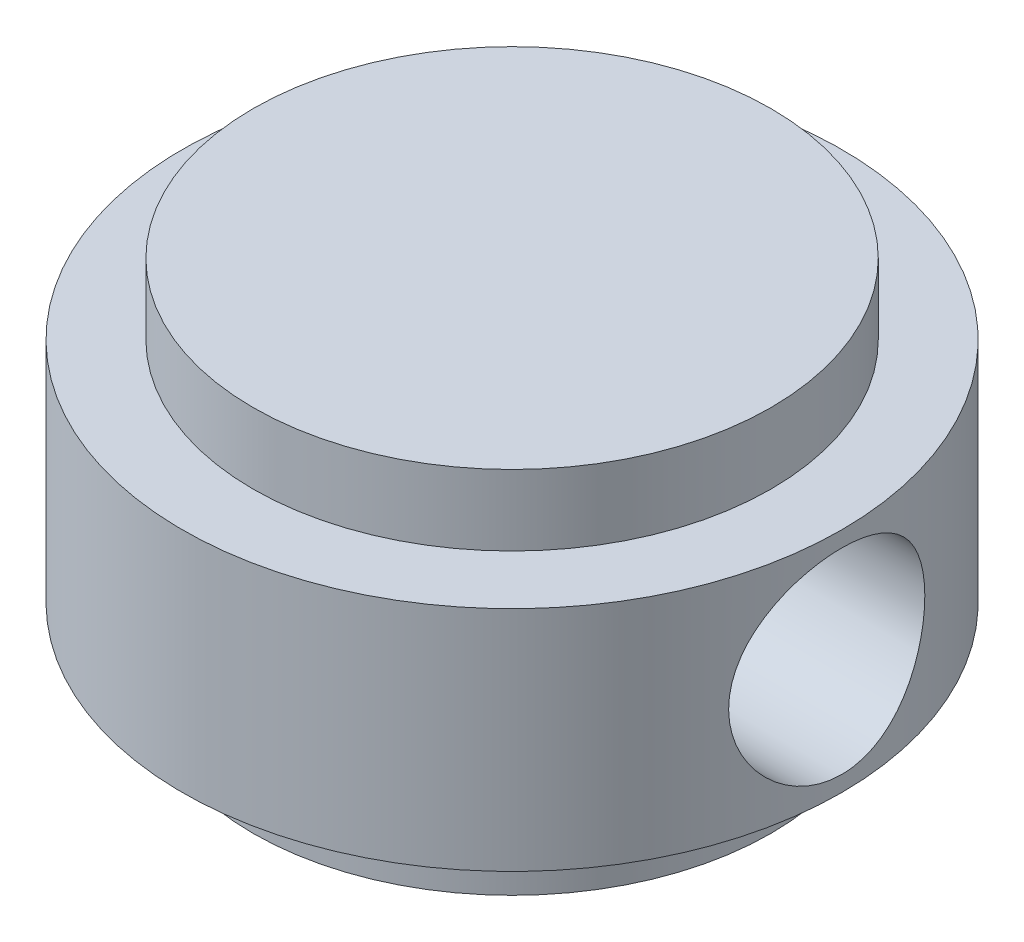
ISO-10303-21;
HEADER;
FILE_DESCRIPTION(('STEP AP214'),'2;1');
FILE_NAME('part.step','',(''),(''),'','','');
FILE_SCHEMA(('AUTOMOTIVE_DESIGN { 1 0 10303 214 1 1 1 1 }'));
ENDSEC;
DATA;
#1=APPLICATION_CONTEXT('core data for automotive mechanical design processes');
#2=APPLICATION_PROTOCOL_DEFINITION('international standard','automotive_design',2000,#1);
#3=PRODUCT_CONTEXT('',#1,'mechanical');
#4=PRODUCT('Part','Part','',(#3));
#5=PRODUCT_RELATED_PRODUCT_CATEGORY('part','',(#4));
#6=PRODUCT_DEFINITION_FORMATION('','',#4);
#7=PRODUCT_DEFINITION_CONTEXT('part definition',#1,'design');
#8=PRODUCT_DEFINITION('design','',#6,#7);
#9=PRODUCT_DEFINITION_SHAPE('','',#8);
#10=(LENGTH_UNIT() NAMED_UNIT(*) SI_UNIT(.MILLI.,.METRE.));
#11=(NAMED_UNIT(*) PLANE_ANGLE_UNIT() SI_UNIT($,.RADIAN.));
#12=(NAMED_UNIT(*) SI_UNIT($,.STERADIAN.) SOLID_ANGLE_UNIT());
#13=UNCERTAINTY_MEASURE_WITH_UNIT(LENGTH_MEASURE(1.E-05),#10,'distance_accuracy_value','');
#14=(GEOMETRIC_REPRESENTATION_CONTEXT(3) GLOBAL_UNCERTAINTY_ASSIGNED_CONTEXT((#13)) GLOBAL_UNIT_ASSIGNED_CONTEXT((#10,
#11,#12)) REPRESENTATION_CONTEXT('',''));
#15=CARTESIAN_POINT('',(0.,0.,0.));
#16=DIRECTION('',(0.,0.,1.));
#17=DIRECTION('',(1.,0.,0.));
#18=AXIS2_PLACEMENT_3D('',#15,#16,#17);
#19=CARTESIAN_POINT('',(750.,-23.4980000000005,1186.5));
#20=DIRECTION('',(0.,-1.,0.));
#21=DIRECTION('',(0.,0.,-1.));
#22=AXIS2_PLACEMENT_3D('',#19,#20,#21);
#23=PLANE('',#22);
#24=CARTESIAN_POINT('',(750.,-23.4980000000005,1186.5));
#25=DIRECTION('',(0.,-1.,0.));
#26=DIRECTION('',(1.,0.,0.));
#27=AXIS2_PLACEMENT_3D('',#24,#25,#26);
#28=CIRCLE('',#27,33.);
#29=CARTESIAN_POINT('',(783.,-23.4980000000005,1186.5));
#30=VERTEX_POINT('',#29);
#31=EDGE_CURVE('E19',#30,#30,#28,.F.);
#32=ORIENTED_EDGE('',*,*,#31,.F.);
#33=EDGE_LOOP('',(#32));
#34=FACE_BOUND('',#33,.T.);
#35=ADVANCED_FACE('F15',(#34),#23,.T.);
#36=CARTESIAN_POINT('',(750.,0.00199999999954403,1186.5));
#37=DIRECTION('',(0.,-1.,0.));
#38=DIRECTION('',(1.,0.,0.));
#39=AXIS2_PLACEMENT_3D('',#36,#37,#38);
#40=CYLINDRICAL_SURFACE('',#39,33.);
#41=CARTESIAN_POINT('',(750.,-14.4980000000005,1186.5));
#42=DIRECTION('',(0.,-1.,0.));
#43=DIRECTION('',(1.,0.,0.));
#44=AXIS2_PLACEMENT_3D('',#41,#42,#43);
#45=CIRCLE('',#44,33.);
#46=CARTESIAN_POINT('',(783.,-14.4980000000005,1186.5));
#47=VERTEX_POINT('',#46);
#48=EDGE_CURVE('E58',#47,#47,#45,.F.);
#49=ORIENTED_EDGE('',*,*,#48,.F.);
#50=EDGE_LOOP('',(#49));
#51=FACE_BOUND('',#50,.T.);
#52=ORIENTED_EDGE('',*,*,#31,.T.);
#53=EDGE_LOOP('',(#52));
#54=FACE_BOUND('',#53,.T.);
#55=ADVANCED_FACE('F65',(#51,#54),#40,.T.);
#56=CARTESIAN_POINT('',(783.,-14.4980000000005,1186.5));
#57=DIRECTION('',(0.,-1.,0.));
#58=DIRECTION('',(0.,0.,-1.));
#59=AXIS2_PLACEMENT_3D('',#56,#57,#58);
#60=PLANE('',#59);
#61=CARTESIAN_POINT('',(750.,-14.4980000000005,1186.5));
#62=DIRECTION('',(0.,-1.,0.));
#63=DIRECTION('',(1.,0.,0.));
#64=AXIS2_PLACEMENT_3D('',#61,#62,#63);
#65=CIRCLE('',#64,42.);
#66=CARTESIAN_POINT('',(792.,-14.4980000000005,1186.5));
#67=VERTEX_POINT('',#66);
#68=EDGE_CURVE('E41',#67,#67,#65,.F.);
#69=ORIENTED_EDGE('',*,*,#68,.F.);
#70=EDGE_LOOP('',(#69));
#71=FACE_BOUND('',#70,.T.);
#72=ORIENTED_EDGE('',*,*,#48,.T.);
#73=EDGE_LOOP('',(#72));
#74=FACE_BOUND('',#73,.T.);
#75=ADVANCED_FACE('F73',(#71,#74),#60,.T.);
#76=CARTESIAN_POINT('',(707.496,0.00199999999954403,1186.5));
#77=DIRECTION('',(1.,0.,0.));
#78=DIRECTION('',(0.,0.,-1.));
#79=AXIS2_PLACEMENT_3D('',#76,#77,#78);
#80=CYLINDRICAL_SURFACE('',#79,12.5);
#81=CARTESIAN_POINT('',(790.096757973682,0.00199999999954342,1174.));
#82=CARTESIAN_POINT('',(790.096752931004,-0.340553838329385,1173.99999355877));
#83=CARTESIAN_POINT('',(790.101156828677,-0.683030388726511,1174.01408685371));
#84=CARTESIAN_POINT('',(790.118623226506,-1.36555628130546,1174.07031787062));
#85=CARTESIAN_POINT('',(790.131687416486,-1.70560513669629,1174.11246106577));
#86=CARTESIAN_POINT('',(790.166087292935,-2.38094781440111,1174.22446174029));
#87=CARTESIAN_POINT('',(790.187429617309,-2.71623759638292,1174.29434146152));
#88=CARTESIAN_POINT('',(790.237727842652,-3.37943062586481,1174.4611942718));
#89=CARTESIAN_POINT('',(790.266684018744,-3.70733360598116,1174.5581683399));
#90=CARTESIAN_POINT('',(790.331277901422,-4.3528753433977,1174.77817736865));
#91=CARTESIAN_POINT('',(790.366902597465,-4.67053269895182,1174.90116164203));
#92=CARTESIAN_POINT('',(790.443834826176,-5.29418251164651,1175.17233149255));
#93=CARTESIAN_POINT('',(790.485142413306,-5.60017485695893,1175.3205173112));
#94=CARTESIAN_POINT('',(790.572266595086,-6.19851784976922,1175.64096084919));
#95=CARTESIAN_POINT('',(790.618082211461,-6.49087143676218,1175.81321334928));
#96=CARTESIAN_POINT('',(790.7129938626,-7.06034657637527,1176.18069075845));
#97=CARTESIAN_POINT('',(790.762091077532,-7.33746258305856,1176.37592395154));
#98=CARTESIAN_POINT('',(790.863636385959,-7.8821847585074,1176.79377978293));
#99=CARTESIAN_POINT('',(790.916139685551,-8.14931254921327,1177.01701285641));
#100=CARTESIAN_POINT('',(791.021792187301,-8.66407962754804,1177.48500562122));
#101=CARTESIAN_POINT('',(791.074941673949,-8.91170994401154,1177.72977511345));
#102=CARTESIAN_POINT('',(791.180437236192,-9.38585719266153,1178.23929301676));
#103=CARTESIAN_POINT('',(791.232783040611,-9.61236712377995,1178.50404800046));
#104=CARTESIAN_POINT('',(791.335217215152,-10.0425918067534,1179.05168659807));
#105=CARTESIAN_POINT('',(791.385306592494,-10.2463167907545,1179.33456198409));
#106=CARTESIAN_POINT('',(791.482927685403,-10.6337505439992,1179.9229569538));
#107=CARTESIAN_POINT('',(791.530382619295,-10.816943119202,1180.22882956604));
#108=CARTESIAN_POINT('',(791.620194040167,-11.1567364397256,1180.8555671668));
#109=CARTESIAN_POINT('',(791.66255250465,-11.3133475088041,1181.17642627283));
#110=CARTESIAN_POINT('',(791.740947538295,-11.5986691474227,1181.83076727725));
#111=CARTESIAN_POINT('',(791.776989262582,-11.7274024885338,1182.16423860994));
#112=CARTESIAN_POINT('',(791.841740060016,-11.9559758708944,1182.84150680085));
#113=CARTESIAN_POINT('',(791.870450961324,-12.0558231165864,1183.18530106079));
#114=CARTESIAN_POINT('',(791.92935815997,-12.2590824088045,1184.01724922288));
#115=CARTESIAN_POINT('',(791.955724139703,-12.3485462259539,1184.50915877299));
#116=CARTESIAN_POINT('',(791.991041470072,-12.4679988190215,1185.50076703473));
#117=CARTESIAN_POINT('',(791.999993748747,-12.4979907644091,1186.00046532983));
#118=CARTESIAN_POINT('',(792.000004291499,-12.4980063402546,1186.84293167642));
#119=CARTESIAN_POINT('',(791.995792451396,-12.4838822688354,1187.18578623881));
#120=CARTESIAN_POINT('',(791.979070035992,-12.4275252091831,1187.86907876489));
#121=CARTESIAN_POINT('',(791.966557853335,-12.3852867766156,1188.20951624761));
#122=CARTESIAN_POINT('',(791.933558612332,-12.2730233906674,1188.88565863781));
#123=CARTESIAN_POINT('',(791.913065007709,-12.2029756274574,1189.22135942549));
#124=CARTESIAN_POINT('',(791.864664788454,-12.0357141944086,1189.88535738483));
#125=CARTESIAN_POINT('',(791.83675850326,-11.9385017318291,1190.21365488481));
#126=CARTESIAN_POINT('',(791.7743368711,-11.7179139400617,1190.86005123754));
#127=CARTESIAN_POINT('',(791.739832896764,-11.594583592274,1191.17816655584));
#128=CARTESIAN_POINT('',(791.665097283398,-11.3226375435505,1191.80269621462));
#129=CARTESIAN_POINT('',(791.624865589219,-11.1740215991524,1192.10911044241));
#130=CARTESIAN_POINT('',(791.539733922766,-10.8526527432771,1192.70822377575));
#131=CARTESIAN_POINT('',(791.494835098069,-10.6799057616844,1193.00092622726));
#132=CARTESIAN_POINT('',(791.401499859207,-10.3113877429146,1193.57101728415));
#133=CARTESIAN_POINT('',(791.353062089805,-10.1156078675934,1193.84839995067));
#134=CARTESIAN_POINT('',(791.252660181394,-9.69718745062769,1194.39281703941));
#135=CARTESIAN_POINT('',(791.200638101242,-9.47399689534884,1194.65941817084));
#136=CARTESIAN_POINT('',(791.09556814095,-9.00620073006256,1195.17312287838));
#137=CARTESIAN_POINT('',(791.042519802942,-8.76158538125812,1195.42021748962));
#138=CARTESIAN_POINT('',(790.936835554863,-8.25248456951418,1195.89331016531));
#139=CARTESIAN_POINT('',(790.884199802253,-7.98799189278175,1196.11930050331));
#140=CARTESIAN_POINT('',(790.780828551039,-7.44098759814266,1196.54851950946));
#141=CARTESIAN_POINT('',(790.730092212619,-7.1584840966187,1196.75175831812));
#142=CARTESIAN_POINT('',(790.63078723256,-6.57042331886705,1197.13860590254));
#143=CARTESIAN_POINT('',(790.582295134205,-6.26448559310024,1197.321656661));
#144=CARTESIAN_POINT('',(790.490238698223,-5.63763644636782,1197.66116067428));
#145=CARTESIAN_POINT('',(790.446672448031,-5.31673090581045,1197.81762426408));
#146=CARTESIAN_POINT('',(790.365832351979,-4.66230131046095,1198.10265208483));
#147=CARTESIAN_POINT('',(790.328553212435,-4.32878816376227,1198.23123981327));
#148=CARTESIAN_POINT('',(790.261443138587,-3.65141572909508,1198.45952818139));
#149=CARTESIAN_POINT('',(790.231610312695,-3.30755909360381,1198.55923615844));
#150=CARTESIAN_POINT('',(790.170395916152,-2.47640818486967,1198.76192224448));
#151=CARTESIAN_POINT('',(790.142930806991,-1.98537570224892,1198.85106877887));
#152=CARTESIAN_POINT('',(790.106116078581,-0.995507220146831,1198.97010109577));
#153=CARTESIAN_POINT('',(790.096765314543,-0.496671715809267,1198.9999906232));
#154=CARTESIAN_POINT('',(790.096752931004,0.344553838328468,1199.00000644123));
#155=CARTESIAN_POINT('',(790.101156828677,0.687030388725589,1198.98591314628));
#156=CARTESIAN_POINT('',(790.118623226505,1.36955628130454,1198.92968212938));
#157=CARTESIAN_POINT('',(790.131687416486,1.70960513669538,1198.88753893423));
#158=CARTESIAN_POINT('',(790.166087292935,2.38494781440019,1198.77553825971));
#159=CARTESIAN_POINT('',(790.187429617309,2.72023759638199,1198.70565853848));
#160=CARTESIAN_POINT('',(790.237727842652,3.38343062586388,1198.5388057282));
#161=CARTESIAN_POINT('',(790.266684018744,3.71133360598024,1198.4418316601));
#162=CARTESIAN_POINT('',(790.331277901422,4.35687534339685,1198.22182263135));
#163=CARTESIAN_POINT('',(790.366902597465,4.67453269895102,1198.09883835797));
#164=CARTESIAN_POINT('',(790.443834826176,5.29818251164573,1197.82766850745));
#165=CARTESIAN_POINT('',(790.485142413306,5.6041748569581,1197.67948268879));
#166=CARTESIAN_POINT('',(790.572266595085,6.20251784976835,1197.35903915081));
#167=CARTESIAN_POINT('',(790.61808221146,6.4948714367613,1197.18678665072));
#168=CARTESIAN_POINT('',(790.7129938626,7.0643465763744,1196.81930924155));
#169=CARTESIAN_POINT('',(790.762091077532,7.3414625830577,1196.62407604845));
#170=CARTESIAN_POINT('',(790.863636385958,7.88618475850651,1196.20622021707));
#171=CARTESIAN_POINT('',(790.91613968555,8.15331254921233,1195.98298714359));
#172=CARTESIAN_POINT('',(791.021792187301,8.66807962754712,1195.51499437878));
#173=CARTESIAN_POINT('',(791.074941673949,8.91570994401068,1195.27022488654));
#174=CARTESIAN_POINT('',(791.180437236192,9.38985719266069,1194.76070698323));
#175=CARTESIAN_POINT('',(791.232783040611,9.6163671237791,1194.49595199954));
#176=CARTESIAN_POINT('',(791.335217215151,10.0465918067526,1193.94831340193));
#177=CARTESIAN_POINT('',(791.385306592494,10.2503167907536,1193.66543801591));
#178=CARTESIAN_POINT('',(791.482927685403,10.6377505439983,1193.07704304619));
#179=CARTESIAN_POINT('',(791.530382619295,10.8209431192011,1192.77117043396));
#180=CARTESIAN_POINT('',(791.620194040167,11.1607364397246,1192.14443283319));
#181=CARTESIAN_POINT('',(791.66255250465,11.3173475088032,1191.82357372716));
#182=CARTESIAN_POINT('',(791.740947538295,11.6026691474218,1191.16923272274));
#183=CARTESIAN_POINT('',(791.776989262582,11.7314024885329,1190.83576139005));
#184=CARTESIAN_POINT('',(791.841740060016,11.9599758708935,1190.15849319915));
#185=CARTESIAN_POINT('',(791.870450961324,12.0598231165855,1189.81469893921));
#186=CARTESIAN_POINT('',(791.92935815997,12.2630824088036,1188.98275077711));
#187=CARTESIAN_POINT('',(791.955724139703,12.352546225953,1188.490841227));
#188=CARTESIAN_POINT('',(791.991041470072,12.4719988190206,1187.49923296527));
#189=CARTESIAN_POINT('',(791.999993748747,12.5019907644083,1186.99953467017));
#190=CARTESIAN_POINT('',(792.000004291499,12.5020063402537,1186.15706832358));
#191=CARTESIAN_POINT('',(791.995792451396,12.4878822688345,1185.81421376119));
#192=CARTESIAN_POINT('',(791.979070035992,12.4315252091821,1185.13092123511));
#193=CARTESIAN_POINT('',(791.966557853335,12.3892867766146,1184.79048375238));
#194=CARTESIAN_POINT('',(791.933558612332,12.2770233906664,1184.11434136219));
#195=CARTESIAN_POINT('',(791.913065007709,12.2069756274563,1183.77864057451));
#196=CARTESIAN_POINT('',(791.864664788454,12.0397141944076,1183.11464261517));
#197=CARTESIAN_POINT('',(791.83675850326,11.942501731828,1182.78634511519));
#198=CARTESIAN_POINT('',(791.7743368711,11.7219139400606,1182.13994876245));
#199=CARTESIAN_POINT('',(791.739832896764,11.5985835922728,1181.82183344416));
#200=CARTESIAN_POINT('',(791.665097283398,11.3266375435493,1181.19730378537));
#201=CARTESIAN_POINT('',(791.624865589219,11.1780215991512,1180.89088955758));
#202=CARTESIAN_POINT('',(791.539733922766,10.856652743276,1180.29177622424));
#203=CARTESIAN_POINT('',(791.494835098069,10.6839057616832,1179.99907377274));
#204=CARTESIAN_POINT('',(791.401499859208,10.3153877429135,1179.42898271584));
#205=CARTESIAN_POINT('',(791.353062089805,10.1196078675922,1179.15160004932));
#206=CARTESIAN_POINT('',(791.252660181394,9.70118745062661,1178.60718296058));
#207=CARTESIAN_POINT('',(791.200638101242,9.47799689534784,1178.34058182916));
#208=CARTESIAN_POINT('',(791.09556814095,9.01020073006156,1177.82687712161));
#209=CARTESIAN_POINT('',(791.042519802942,8.76558538125705,1177.57978251038));
#210=CARTESIAN_POINT('',(790.936835554863,8.25648456951302,1177.10668983469));
#211=CARTESIAN_POINT('',(790.884199802253,7.99199189278058,1176.88069949668));
#212=CARTESIAN_POINT('',(790.78082855104,7.44498759814143,1176.45148049053));
#213=CARTESIAN_POINT('',(790.730092212619,7.1624840966174,1176.24824168187));
#214=CARTESIAN_POINT('',(790.63078723256,6.57442331886574,1175.86139409746));
#215=CARTESIAN_POINT('',(790.582295134205,6.26848559309898,1175.678343339));
#216=CARTESIAN_POINT('',(790.490238698223,5.64163644636656,1175.33883932572));
#217=CARTESIAN_POINT('',(790.446672448031,5.32073090580915,1175.18237573591));
#218=CARTESIAN_POINT('',(790.365832351979,4.66630131045967,1174.89734791517));
#219=CARTESIAN_POINT('',(790.328553212435,4.33278816376104,1174.76876018673));
#220=CARTESIAN_POINT('',(790.261443138587,3.65541572909384,1174.5404718186));
#221=CARTESIAN_POINT('',(790.231610312696,3.31155909360251,1174.44076384156));
#222=CARTESIAN_POINT('',(790.170395916152,2.48040818486837,1174.23807775552));
#223=CARTESIAN_POINT('',(790.142930806991,1.98937570224772,1174.14893122112));
#224=CARTESIAN_POINT('',(790.106116078581,0.999507220145797,1174.02989890422));
#225=CARTESIAN_POINT('',(790.096765314543,0.500671715808294,1174.0000093768));
#226=CARTESIAN_POINT('',(790.096757973682,0.00199999999954342,1174.));
#227=B_SPLINE_CURVE_WITH_KNOTS('',3,(#81,#82,#83,#84,#85,#86,#87,#88,#89,#90,#91,#92,#93,#94,
#95,#96,#97,#98,#99,#100,#101,#102,#103,#104,#105,#106,#107,#108,#109,#110,#111,#112,#113,#114,
#115,#116,#117,#118,#119,#120,#121,#122,#123,#124,#125,#126,#127,#128,#129,#130,#131,#132,#133,
#134,#135,#136,#137,#138,#139,#140,#141,#142,#143,#144,#145,#146,#147,#148,#149,#150,#151,#152,
#153,#154,#155,#156,#157,#158,#159,#160,#161,#162,#163,#164,#165,#166,#167,#168,#169,#170,#171,
#172,#173,#174,#175,#176,#177,#178,#179,#180,#181,#182,#183,#184,#185,#186,#187,#188,#189,#190,
#191,#192,#193,#194,#195,#196,#197,#198,#199,#200,#201,#202,#203,#204,#205,#206,#207,#208,#209,
#210,#211,#212,#213,#214,#215,#216,#217,#218,#219,#220,#221,#222,#223,#224,#225,#226),
.UNSPECIFIED.,.T.,.F.,(4,2,2,2,2,2,2,2,2,2,2,2,2,2,2,2,2,2,2,2,2,2,2,2,2,2,2,2,2,2,2,2,2,2,2,2,
2,2,2,2,2,2,2,2,2,2,2,2,2,2,2,2,2,2,2,2,2,2,2,2,2,2,2,2,2,2,2,2,2,2,2,2,4),(0.,1.02721122183593,
2.05462293546755,3.08286019832547,4.11113462118587,5.13742336482281,6.16372194463815,
7.18979829965901,8.21624567104374,9.27122161498172,10.3266801710514,11.3824873600251,
12.4378184924744,13.5155332560336,14.5928284928614,15.6692404073486,16.7453836234745,
18.2434139267945,19.7413643925585,20.7697107618862,21.7982563280198,22.827647278793,
23.8569924884372,24.8845791246474,25.9121756555351,26.9395201108849,27.9672600708807,
29.0207452968353,30.0747119024674,31.1290628735369,32.182942026,33.2610245035678,
34.3386869446903,35.4154374252074,36.491914099778,37.9873682470498,39.4827278815815,
40.5099391034175,41.5373508170491,42.5655880799069,43.5938625027675,44.6201512464045,
45.6464498262198,46.6725261812405,47.6989735526254,48.7539494965633,49.8094080526331,
50.8652152416068,51.920546374056,52.998261137615,54.075556374443,55.15196828893,
56.2281115050561,57.7261418083764,59.2240922741408,60.2524386434686,61.2809842096021,
62.3103751603752,63.3397203700193,64.3673070062298,65.3949035371172,66.4222479924668,
67.4499879524626,68.503473178417,69.5574397840491,70.6117907551187,71.665669907582,
72.7437523851498,73.8214148262722,74.8981653067893,75.97464198136,77.4700961286315,
78.9654557631631),.UNSPECIFIED.);
#228=CARTESIAN_POINT('',(790.096757973682,0.00199999999954342,1174.));
#229=VERTEX_POINT('',#228);
#230=EDGE_CURVE('E33',#229,#229,#227,.T.);
#231=ORIENTED_EDGE('',*,*,#230,.F.);
#232=EDGE_LOOP('',(#231));
#233=FACE_BOUND('',#232,.T.);
#234=CARTESIAN_POINT('',(708.,12.5019999999995,1186.5));
#235=CARTESIAN_POINT('',(707.9999957085,12.5020063402537,1186.84293167642));
#236=CARTESIAN_POINT('',(708.004207548604,12.4878822688345,1187.18578623881));
#237=CARTESIAN_POINT('',(708.020929964008,12.4315252091821,1187.86907876489));
#238=CARTESIAN_POINT('',(708.033442146664,12.3892867766146,1188.20951624761));
#239=CARTESIAN_POINT('',(708.066441387668,12.2770233906664,1188.88565863781));
#240=CARTESIAN_POINT('',(708.08693499229,12.2069756274563,1189.22135942549));
#241=CARTESIAN_POINT('',(708.135335211546,12.0397141944076,1189.88535738483));
#242=CARTESIAN_POINT('',(708.163241496739,11.9425017318281,1190.21365488481));
#243=CARTESIAN_POINT('',(708.225663128899,11.7219139400607,1190.86005123754));
#244=CARTESIAN_POINT('',(708.260167103235,11.5985835922729,1191.17816655584));
#245=CARTESIAN_POINT('',(708.334902716601,11.3266375435495,1191.80269621462));
#246=CARTESIAN_POINT('',(708.37513441078,11.1780215991514,1192.10911044241));
#247=CARTESIAN_POINT('',(708.460266077234,10.8566527432761,1192.70822377575));
#248=CARTESIAN_POINT('',(708.505164901931,10.6839057616834,1193.00092622726));
#249=CARTESIAN_POINT('',(708.598500140792,10.3153877429136,1193.57101728415));
#250=CARTESIAN_POINT('',(708.646937910195,10.1196078675923,1193.84839995067));
#251=CARTESIAN_POINT('',(708.747339818605,9.70118745062668,1194.39281703941));
#252=CARTESIAN_POINT('',(708.799361898758,9.47799689534788,1194.65941817084));
#253=CARTESIAN_POINT('',(708.90443185905,9.01020073006159,1195.17312287838));
#254=CARTESIAN_POINT('',(708.957480197058,8.76558538125709,1195.42021748962));
#255=CARTESIAN_POINT('',(709.063164445137,8.25648456951303,1195.89331016531));
#256=CARTESIAN_POINT('',(709.115800197747,7.99199189278053,1196.11930050331));
#257=CARTESIAN_POINT('',(709.21917144896,7.44498759814139,1196.54851950946));
#258=CARTESIAN_POINT('',(709.26990778738,7.16248409661746,1196.75175831812));
#259=CARTESIAN_POINT('',(709.369212767439,6.57442331886576,1197.13860590254));
#260=CARTESIAN_POINT('',(709.417704865795,6.26848559309888,1197.321656661));
#261=CARTESIAN_POINT('',(709.509761301777,5.64163644636643,1197.66116067428));
#262=CARTESIAN_POINT('',(709.553327551968,5.32073090580911,1197.81762426408));
#263=CARTESIAN_POINT('',(709.634167648021,4.66630131045968,1198.10265208483));
#264=CARTESIAN_POINT('',(709.671446787564,4.33278816376101,1198.23123981327));
#265=CARTESIAN_POINT('',(709.738556861412,3.6554157290938,1198.45952818139));
#266=CARTESIAN_POINT('',(709.768389687304,3.31155909360251,1198.55923615844));
#267=CARTESIAN_POINT('',(709.829604083848,2.48040818486841,1198.76192224448));
#268=CARTESIAN_POINT('',(709.857069193009,1.98937570224772,1198.85106877887));
#269=CARTESIAN_POINT('',(709.893883921418,0.999507220145778,1198.97010109577));
#270=CARTESIAN_POINT('',(709.903234685456,0.500671715808289,1198.9999906232));
#271=CARTESIAN_POINT('',(709.903247068995,-0.340553838329378,1199.00000644123));
#272=CARTESIAN_POINT('',(709.898843171323,-0.683030388726502,1198.98591314628));
#273=CARTESIAN_POINT('',(709.881376773494,-1.36555628130544,1198.92968212938));
#274=CARTESIAN_POINT('',(709.868312583514,-1.70560513669626,1198.88753893423));
#275=CARTESIAN_POINT('',(709.833912707064,-2.38094781440111,1198.77553825971));
#276=CARTESIAN_POINT('',(709.812570382691,-2.71623759638295,1198.70565853848));
#277=CARTESIAN_POINT('',(709.762272157348,-3.37943062586484,1198.5388057282));
#278=CARTESIAN_POINT('',(709.733315981256,-3.70733360598117,1198.4418316601));
#279=CARTESIAN_POINT('',(709.668722098578,-4.35287534339774,1198.22182263135));
#280=CARTESIAN_POINT('',(709.633097402535,-4.67053269895194,1198.09883835797));
#281=CARTESIAN_POINT('',(709.556165173824,-5.29418251164665,1197.82766850745));
#282=CARTESIAN_POINT('',(709.514857586693,-5.60017485695902,1197.67948268879));
#283=CARTESIAN_POINT('',(709.427733404914,-6.19851784976926,1197.3590391508));
#284=CARTESIAN_POINT('',(709.381917788539,-6.4908714367622,1197.18678665072));
#285=CARTESIAN_POINT('',(709.2870061374,-7.06034657637528,1196.81930924155));
#286=CARTESIAN_POINT('',(709.237908922467,-7.33746258305855,1196.62407604845));
#287=CARTESIAN_POINT('',(709.136363614041,-7.88218475850732,1196.20622021707));
#288=CARTESIAN_POINT('',(709.083860314449,-8.14931254921313,1195.98298714359));
#289=CARTESIAN_POINT('',(708.978207812699,-8.66407962754783,1195.51499437878));
#290=CARTESIAN_POINT('',(708.925058326051,-8.91170994401129,1195.27022488654));
#291=CARTESIAN_POINT('',(708.819562763807,-9.38585719266128,1194.76070698323));
#292=CARTESIAN_POINT('',(708.767216959389,-9.61236712377975,1194.49595199954));
#293=CARTESIAN_POINT('',(708.664782784848,-10.0425918067534,1193.94831340193));
#294=CARTESIAN_POINT('',(708.614693407506,-10.2463167907545,1193.66543801591));
#295=CARTESIAN_POINT('',(708.517072314597,-10.6337505439992,1193.07704304619));
#296=CARTESIAN_POINT('',(708.469617380704,-10.816943119202,1192.77117043395));
#297=CARTESIAN_POINT('',(708.379805959833,-11.1567364397256,1192.14443283319));
#298=CARTESIAN_POINT('',(708.337447495349,-11.3133475088041,1191.82357372716));
#299=CARTESIAN_POINT('',(708.259052461705,-11.5986691474227,1191.16923272274));
#300=CARTESIAN_POINT('',(708.223010737418,-11.7274024885338,1190.83576139005));
#301=CARTESIAN_POINT('',(708.158259939983,-11.9559758708944,1190.15849319914));
#302=CARTESIAN_POINT('',(708.129549038675,-12.0558231165864,1189.81469893921));
#303=CARTESIAN_POINT('',(708.070641840029,-12.2590824088045,1188.98275077711));
#304=CARTESIAN_POINT('',(708.044275860297,-12.3485462259539,1188.490841227));
#305=CARTESIAN_POINT('',(708.008958529928,-12.4679988190215,1187.49923296527));
#306=CARTESIAN_POINT('',(708.000006251253,-12.4979907644092,1186.99953467017));
#307=CARTESIAN_POINT('',(707.9999957085,-12.4980063402546,1186.15706832358));
#308=CARTESIAN_POINT('',(708.004207548604,-12.4838822688354,1185.81421376119));
#309=CARTESIAN_POINT('',(708.020929964008,-12.4275252091831,1185.13092123511));
#310=CARTESIAN_POINT('',(708.033442146664,-12.3852867766155,1184.79048375238));
#311=CARTESIAN_POINT('',(708.066441387668,-12.2730233906673,1184.11434136219));
#312=CARTESIAN_POINT('',(708.08693499229,-12.2029756274572,1183.77864057451));
#313=CARTESIAN_POINT('',(708.135335211546,-12.0357141944085,1183.11464261517));
#314=CARTESIAN_POINT('',(708.163241496739,-11.938501731829,1182.78634511519));
#315=CARTESIAN_POINT('',(708.225663128899,-11.7179139400616,1182.13994876245));
#316=CARTESIAN_POINT('',(708.260167103235,-11.5945835922738,1181.82183344416));
#317=CARTESIAN_POINT('',(708.334902716601,-11.3226375435504,1181.19730378537));
#318=CARTESIAN_POINT('',(708.37513441078,-11.1740215991523,1180.89088955758));
#319=CARTESIAN_POINT('',(708.460266077234,-10.852652743277,1180.29177622424));
#320=CARTESIAN_POINT('',(708.505164901931,-10.6799057616843,1179.99907377274));
#321=CARTESIAN_POINT('',(708.598500140792,-10.3113877429145,1179.42898271584));
#322=CARTESIAN_POINT('',(708.646937910195,-10.1156078675933,1179.15160004932));
#323=CARTESIAN_POINT('',(708.747339818605,-9.69718745062762,1178.60718296058));
#324=CARTESIAN_POINT('',(708.799361898757,-9.47399689534883,1178.34058182916));
#325=CARTESIAN_POINT('',(708.90443185905,-9.00620073006255,1177.82687712161));
#326=CARTESIAN_POINT('',(708.957480197058,-8.76158538125804,1177.57978251038));
#327=CARTESIAN_POINT('',(709.063164445137,-8.25248456951394,1177.10668983469));
#328=CARTESIAN_POINT('',(709.115800197747,-7.98799189278143,1176.88069949668));
#329=CARTESIAN_POINT('',(709.21917144896,-7.44098759814228,1176.45148049053));
#330=CARTESIAN_POINT('',(709.26990778738,-7.15848409661835,1176.24824168187));
#331=CARTESIAN_POINT('',(709.369212767439,-6.5704233188667,1175.86139409746));
#332=CARTESIAN_POINT('',(709.417704865795,-6.26448559309986,1175.678343339));
#333=CARTESIAN_POINT('',(709.509761301777,-5.6376364463674,1175.33883932572));
#334=CARTESIAN_POINT('',(709.553327551968,-5.31673090581004,1175.18237573591));
#335=CARTESIAN_POINT('',(709.634167648021,-4.66230131046057,1174.89734791517));
#336=CARTESIAN_POINT('',(709.671446787564,-4.3287881637619,1174.76876018673));
#337=CARTESIAN_POINT('',(709.738556861412,-3.6514157290947,1174.5404718186));
#338=CARTESIAN_POINT('',(709.768389687304,-3.30755909360341,1174.44076384156));
#339=CARTESIAN_POINT('',(709.829604083848,-2.47640818486931,1174.23807775552));
#340=CARTESIAN_POINT('',(709.857069193009,-1.98537570224863,1174.14893122112));
#341=CARTESIAN_POINT('',(709.893883921418,-0.995507220146675,1174.02989890422));
#342=CARTESIAN_POINT('',(709.903234685456,-0.496671715809174,1174.0000093768));
#343=CARTESIAN_POINT('',(709.903247068995,0.344553838328512,1173.99999355877));
#344=CARTESIAN_POINT('',(709.898843171323,0.687030388725642,1174.01408685371));
#345=CARTESIAN_POINT('',(709.881376773494,1.3695562813046,1174.07031787062));
#346=CARTESIAN_POINT('',(709.868312583514,1.70960513669543,1174.11246106577));
#347=CARTESIAN_POINT('',(709.833912707064,2.38494781440027,1174.22446174029));
#348=CARTESIAN_POINT('',(709.812570382691,2.72023759638209,1174.29434146152));
#349=CARTESIAN_POINT('',(709.762272157348,3.38343062586396,1174.4611942718));
#350=CARTESIAN_POINT('',(709.733315981256,3.71133360598028,1174.5581683399));
#351=CARTESIAN_POINT('',(709.668722098578,4.35687534339684,1174.77817736865));
#352=CARTESIAN_POINT('',(709.633097402535,4.67453269895103,1174.90116164203));
#353=CARTESIAN_POINT('',(709.556165173824,5.29818251164573,1175.17233149255));
#354=CARTESIAN_POINT('',(709.514857586693,5.6041748569581,1175.3205173112));
#355=CARTESIAN_POINT('',(709.427733404914,6.20251784976835,1175.64096084919));
#356=CARTESIAN_POINT('',(709.381917788539,6.4948714367613,1175.81321334928));
#357=CARTESIAN_POINT('',(709.2870061374,7.06434657637438,1176.18069075845));
#358=CARTESIAN_POINT('',(709.237908922467,7.34146258305765,1176.37592395154));
#359=CARTESIAN_POINT('',(709.136363614041,7.88618475850648,1176.79377978292));
#360=CARTESIAN_POINT('',(709.083860314449,8.15331254921236,1177.01701285641));
#361=CARTESIAN_POINT('',(708.978207812699,8.66807962754716,1177.48500562122));
#362=CARTESIAN_POINT('',(708.925058326051,8.91570994401068,1177.72977511345));
#363=CARTESIAN_POINT('',(708.819562763807,9.38985719266068,1178.23929301676));
#364=CARTESIAN_POINT('',(708.767216959389,9.61636712377911,1178.50404800046));
#365=CARTESIAN_POINT('',(708.664782784848,10.0465918067526,1179.05168659807));
#366=CARTESIAN_POINT('',(708.614693407506,10.2503167907536,1179.33456198409));
#367=CARTESIAN_POINT('',(708.517072314597,10.6377505439983,1179.9229569538));
#368=CARTESIAN_POINT('',(708.469617380704,10.8209431192011,1180.22882956604));
#369=CARTESIAN_POINT('',(708.379805959833,11.1607364397247,1180.8555671668));
#370=CARTESIAN_POINT('',(708.337447495349,11.3173475088033,1181.17642627283));
#371=CARTESIAN_POINT('',(708.259052461705,11.6026691474218,1181.83076727725));
#372=CARTESIAN_POINT('',(708.223010737418,11.7314024885329,1182.16423860994));
#373=CARTESIAN_POINT('',(708.158259939983,11.9599758708935,1182.84150680085));
#374=CARTESIAN_POINT('',(708.129549038675,12.0598231165856,1183.18530106079));
#375=CARTESIAN_POINT('',(708.070641840029,12.2630824088036,1184.01724922288));
#376=CARTESIAN_POINT('',(708.044275860297,12.352546225953,1184.50915877299));
#377=CARTESIAN_POINT('',(708.008958529928,12.4719988190206,1185.50076703473));
#378=CARTESIAN_POINT('',(708.000006251253,12.5019907644082,1186.00046532983));
#379=CARTESIAN_POINT('',(708.,12.5019999999995,1186.5));
#380=B_SPLINE_CURVE_WITH_KNOTS('',3,(#234,#235,#236,#237,#238,#239,#240,#241,#242,#243,#244,
#245,#246,#247,#248,#249,#250,#251,#252,#253,#254,#255,#256,#257,#258,#259,#260,#261,#262,#263,
#264,#265,#266,#267,#268,#269,#270,#271,#272,#273,#274,#275,#276,#277,#278,#279,#280,#281,#282,
#283,#284,#285,#286,#287,#288,#289,#290,#291,#292,#293,#294,#295,#296,#297,#298,#299,#300,#301,
#302,#303,#304,#305,#306,#307,#308,#309,#310,#311,#312,#313,#314,#315,#316,#317,#318,#319,#320,
#321,#322,#323,#324,#325,#326,#327,#328,#329,#330,#331,#332,#333,#334,#335,#336,#337,#338,#339,
#340,#341,#342,#343,#344,#345,#346,#347,#348,#349,#350,#351,#352,#353,#354,#355,#356,#357,#358,
#359,#360,#361,#362,#363,#364,#365,#366,#367,#368,#369,#370,#371,#372,#373,#374,#375,#376,#377,
#378,#379),.UNSPECIFIED.,.T.,.F.,(4,2,2,2,2,2,2,2,2,2,2,2,2,2,2,2,2,2,2,2,2,2,2,2,2,2,2,2,2,2,2,
2,2,2,2,2,2,2,2,2,2,2,2,2,2,2,2,2,2,2,2,2,2,2,2,2,2,2,2,2,2,2,2,2,2,2,2,2,2,2,2,2,4),(0.,
1.02834636932777,2.05689193546159,3.0862828862346,4.11562809587876,5.14321473208901,
6.17081126297643,7.19815571832624,8.22589567832205,9.27938090427665,10.3333475099088,
11.3876984809784,12.4415776334416,13.5196601110096,14.5973225521319,15.6740730326489,
16.7505497072196,18.2460038544912,19.7413634890228,20.7685747108587,21.7959864244903,
22.8242236873483,23.8524981102087,24.8787868538458,25.9050854336611,26.9311617886817,
27.9576091600665,29.0125851040041,30.0680436600738,31.1238508490475,32.1791819814973,
33.2568967450563,34.3341919818841,35.4106038963713,36.4867471124972,37.9847774158177,
39.4827278815816,40.5110742509094,41.5396198170432,42.5690107678162,43.5983559774604,
44.6259426136706,45.653539144558,46.6808835999078,47.7086235599036,48.762108785858,
49.8160753914904,50.87042636256,51.9243055150232,53.0023879925911,54.0800504337135,
55.1568009142305,56.2332775888012,57.7287317360728,59.2240913706044,60.2513025924403,
61.2787143060719,62.3069515689299,63.3352259917903,64.3615147354274,65.3878133152426,
66.4138896702633,67.440337041648,68.495312985586,69.5507715416559,70.6065787306296,
71.6619098630788,72.7396246266379,73.8169198634659,74.8933317779529,75.969474994079,
77.4675052973993,78.9654557631632),.UNSPECIFIED.);
#381=CARTESIAN_POINT('',(708.,12.5019999999995,1186.5));
#382=VERTEX_POINT('',#381);
#383=EDGE_CURVE('E53',#382,#382,#380,.T.);
#384=ORIENTED_EDGE('',*,*,#383,.F.);
#385=EDGE_LOOP('',(#384));
#386=FACE_BOUND('',#385,.T.);
#387=ADVANCED_FACE('F43',(#233,#386),#80,.F.);
#388=CARTESIAN_POINT('',(750.,0.00199999999954403,1186.5));
#389=DIRECTION('',(0.,-1.,0.));
#390=DIRECTION('',(1.,0.,0.));
#391=AXIS2_PLACEMENT_3D('',#388,#389,#390);
#392=CYLINDRICAL_SURFACE('',#391,42.);
#393=CARTESIAN_POINT('',(750.,14.5019999999995,1186.5));
#394=DIRECTION('',(0.,-1.,0.));
#395=DIRECTION('',(1.,0.,0.));
#396=AXIS2_PLACEMENT_3D('',#393,#394,#395);
#397=CIRCLE('',#396,42.);
#398=CARTESIAN_POINT('',(792.,14.5019999999995,1186.5));
#399=VERTEX_POINT('',#398);
#400=EDGE_CURVE('E28',#399,#399,#397,.F.);
#401=ORIENTED_EDGE('',*,*,#400,.F.);
#402=EDGE_LOOP('',(#401));
#403=FACE_BOUND('',#402,.T.);
#404=ORIENTED_EDGE('',*,*,#383,.T.);
#405=EDGE_LOOP('',(#404));
#406=FACE_BOUND('',#405,.T.);
#407=ORIENTED_EDGE('',*,*,#68,.T.);
#408=EDGE_LOOP('',(#407));
#409=FACE_BOUND('',#408,.T.);
#410=ORIENTED_EDGE('',*,*,#230,.T.);
#411=EDGE_LOOP('',(#410));
#412=FACE_BOUND('',#411,.T.);
#413=ADVANCED_FACE('F46',(#403,#406,#409,#412),#392,.T.);
#414=CARTESIAN_POINT('',(792.,14.5019999999995,1186.5));
#415=DIRECTION('',(0.,1.,0.));
#416=DIRECTION('',(0.,0.,1.));
#417=AXIS2_PLACEMENT_3D('',#414,#415,#416);
#418=PLANE('',#417);
#419=CARTESIAN_POINT('',(750.,14.5019999999995,1186.5));
#420=DIRECTION('',(0.,-1.,0.));
#421=DIRECTION('',(1.,0.,0.));
#422=AXIS2_PLACEMENT_3D('',#419,#420,#421);
#423=CIRCLE('',#422,33.);
#424=CARTESIAN_POINT('',(783.,14.5019999999995,1186.5));
#425=VERTEX_POINT('',#424);
#426=EDGE_CURVE('E23',#425,#425,#423,.F.);
#427=ORIENTED_EDGE('',*,*,#426,.F.);
#428=EDGE_LOOP('',(#427));
#429=FACE_BOUND('',#428,.T.);
#430=ORIENTED_EDGE('',*,*,#400,.T.);
#431=EDGE_LOOP('',(#430));
#432=FACE_BOUND('',#431,.T.);
#433=ADVANCED_FACE('F50',(#429,#432),#418,.T.);
#434=CARTESIAN_POINT('',(750.,0.00199999999954403,1186.5));
#435=DIRECTION('',(0.,-1.,0.));
#436=DIRECTION('',(1.,0.,0.));
#437=AXIS2_PLACEMENT_3D('',#434,#435,#436);
#438=CYLINDRICAL_SURFACE('',#437,33.);
#439=ORIENTED_EDGE('',*,*,#426,.T.);
#440=EDGE_LOOP('',(#439));
#441=FACE_BOUND('',#440,.T.);
#442=CARTESIAN_POINT('',(750.,23.5019999999995,1186.5));
#443=DIRECTION('',(0.,-1.,0.));
#444=DIRECTION('',(1.,0.,0.));
#445=AXIS2_PLACEMENT_3D('',#442,#443,#444);
#446=CIRCLE('',#445,33.);
#447=CARTESIAN_POINT('',(783.,23.5019999999995,1186.5));
#448=VERTEX_POINT('',#447);
#449=EDGE_CURVE('E10',#448,#448,#446,.F.);
#450=ORIENTED_EDGE('',*,*,#449,.F.);
#451=EDGE_LOOP('',(#450));
#452=FACE_BOUND('',#451,.T.);
#453=ADVANCED_FACE('F77',(#441,#452),#438,.T.);
#454=CARTESIAN_POINT('',(783.,23.5019999999995,1186.5));
#455=DIRECTION('',(0.,1.,0.));
#456=DIRECTION('',(0.,0.,1.));
#457=AXIS2_PLACEMENT_3D('',#454,#455,#456);
#458=PLANE('',#457);
#459=ORIENTED_EDGE('',*,*,#449,.T.);
#460=EDGE_LOOP('',(#459));
#461=FACE_BOUND('',#460,.T.);
#462=ADVANCED_FACE('F17',(#461),#458,.T.);
#463=CLOSED_SHELL('',(#35,#55,#75,#387,#413,#433,#453,#462));
#464=MANIFOLD_SOLID_BREP('B1',#463);
#465=ADVANCED_BREP_SHAPE_REPRESENTATION('',(#18,#464),#14);
#466=SHAPE_DEFINITION_REPRESENTATION(#9,#465);
ENDSEC;
END-ISO-10303-21;
